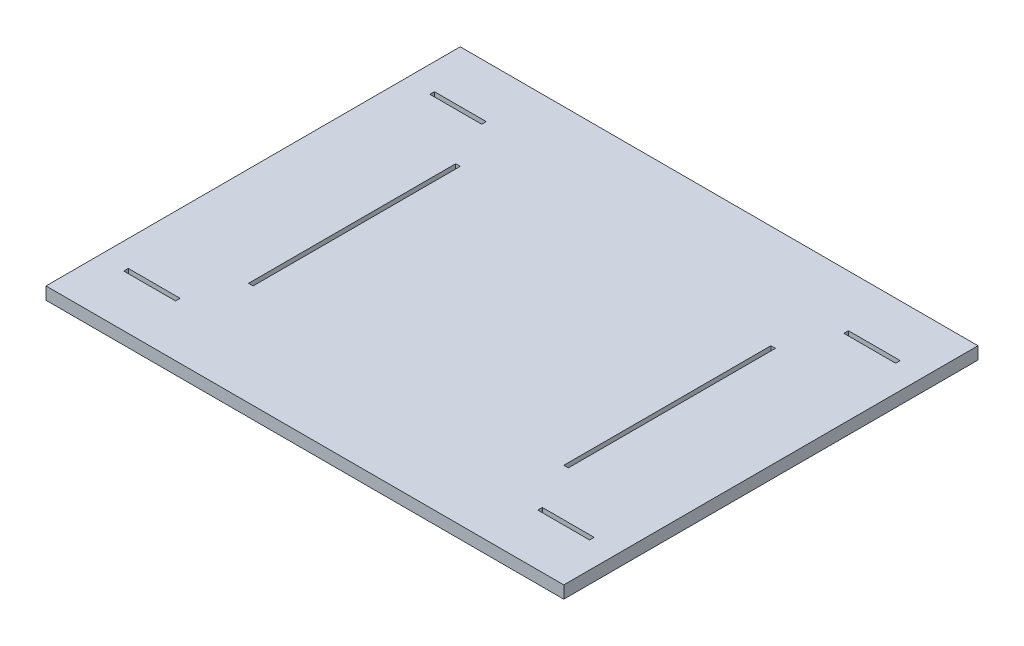
ISO-10303-21;
HEADER;
FILE_DESCRIPTION(('STEP AP214'),'2;1');
FILE_NAME('part.step','',(''),(''),'','','');
FILE_SCHEMA(('AUTOMOTIVE_DESIGN { 1 0 10303 214 1 1 1 1 }'));
ENDSEC;
DATA;
#1=APPLICATION_CONTEXT('core data for automotive mechanical design processes');
#2=APPLICATION_PROTOCOL_DEFINITION('international standard','automotive_design',2000,#1);
#3=PRODUCT_CONTEXT('',#1,'mechanical');
#4=PRODUCT('Part','Part','',(#3));
#5=PRODUCT_RELATED_PRODUCT_CATEGORY('part','',(#4));
#6=PRODUCT_DEFINITION_FORMATION('','',#4);
#7=PRODUCT_DEFINITION_CONTEXT('part definition',#1,'design');
#8=PRODUCT_DEFINITION('design','',#6,#7);
#9=PRODUCT_DEFINITION_SHAPE('','',#8);
#10=(LENGTH_UNIT() NAMED_UNIT(*) SI_UNIT(.MILLI.,.METRE.));
#11=(NAMED_UNIT(*) PLANE_ANGLE_UNIT() SI_UNIT($,.RADIAN.));
#12=(NAMED_UNIT(*) SI_UNIT($,.STERADIAN.) SOLID_ANGLE_UNIT());
#13=UNCERTAINTY_MEASURE_WITH_UNIT(LENGTH_MEASURE(1.E-05),#10,'distance_accuracy_value','');
#14=(GEOMETRIC_REPRESENTATION_CONTEXT(3) GLOBAL_UNCERTAINTY_ASSIGNED_CONTEXT((#13)) GLOBAL_UNIT_ASSIGNED_CONTEXT((#10,
#11,#12)) REPRESENTATION_CONTEXT('',''));
#15=CARTESIAN_POINT('',(0.,0.,0.));
#16=DIRECTION('',(0.,0.,1.));
#17=DIRECTION('',(1.,0.,0.));
#18=AXIS2_PLACEMENT_3D('',#15,#16,#17);
#19=CARTESIAN_POINT('',(-250.,12.,-200.));
#20=DIRECTION('',(0.,0.,-1.));
#21=DIRECTION('',(-1.,0.,0.));
#22=AXIS2_PLACEMENT_3D('',#19,#20,#21);
#23=PLANE('',#22);
#24=DIRECTION('',(1.,0.,0.));
#25=VECTOR('',#24,1.);
#26=CARTESIAN_POINT('',(-250.,0.,-200.));
#27=LINE('',#26,#25);
#28=CARTESIAN_POINT('',(-250.,0.,-200.));
#29=VERTEX_POINT('',#28);
#30=CARTESIAN_POINT('',(250.,0.,-200.));
#31=VERTEX_POINT('',#30);
#32=EDGE_CURVE('E317',#29,#31,#27,.T.);
#33=ORIENTED_EDGE('',*,*,#32,.F.);
#34=DIRECTION('',(0.,-1.,0.));
#35=VECTOR('',#34,1.);
#36=CARTESIAN_POINT('',(-250.,12.,-200.));
#37=LINE('',#36,#35);
#38=CARTESIAN_POINT('',(-250.,12.,-200.));
#39=VERTEX_POINT('',#38);
#40=EDGE_CURVE('E12',#39,#29,#37,.T.);
#41=ORIENTED_EDGE('',*,*,#40,.F.);
#42=DIRECTION('',(1.,0.,0.));
#43=VECTOR('',#42,1.);
#44=CARTESIAN_POINT('',(-250.,12.,-200.));
#45=LINE('',#44,#43);
#46=CARTESIAN_POINT('',(250.,12.,-200.));
#47=VERTEX_POINT('',#46);
#48=EDGE_CURVE('E345',#39,#47,#45,.T.);
#49=ORIENTED_EDGE('',*,*,#48,.T.);
#50=DIRECTION('',(0.,-1.,0.));
#51=VECTOR('',#50,1.);
#52=CARTESIAN_POINT('',(250.,12.,-200.));
#53=LINE('',#52,#51);
#54=EDGE_CURVE('E49',#47,#31,#53,.T.);
#55=ORIENTED_EDGE('',*,*,#54,.T.);
#56=EDGE_LOOP('',(#33,#41,#49,#55));
#57=FACE_BOUND('',#56,.T.);
#58=ADVANCED_FACE('F46',(#57),#23,.T.);
#59=CARTESIAN_POINT('',(-250.,12.,-200.));
#60=DIRECTION('',(1.,0.,0.));
#61=DIRECTION('',(0.,0.,-1.));
#62=AXIS2_PLACEMENT_3D('',#59,#60,#61);
#63=PLANE('',#62);
#64=DIRECTION('',(0.,0.,1.));
#65=VECTOR('',#64,1.);
#66=CARTESIAN_POINT('',(-250.,0.,-200.));
#67=LINE('',#66,#65);
#68=CARTESIAN_POINT('',(-250.,0.,200.));
#69=VERTEX_POINT('',#68);
#70=EDGE_CURVE('E343',#29,#69,#67,.T.);
#71=ORIENTED_EDGE('',*,*,#70,.T.);
#72=DIRECTION('',(0.,-1.,0.));
#73=VECTOR('',#72,1.);
#74=CARTESIAN_POINT('',(-250.,12.,200.));
#75=LINE('',#74,#73);
#76=CARTESIAN_POINT('',(-250.,12.,200.));
#77=VERTEX_POINT('',#76);
#78=EDGE_CURVE('E55',#77,#69,#75,.T.);
#79=ORIENTED_EDGE('',*,*,#78,.F.);
#80=DIRECTION('',(0.,0.,1.));
#81=VECTOR('',#80,1.);
#82=CARTESIAN_POINT('',(-250.,12.,-200.));
#83=LINE('',#82,#81);
#84=EDGE_CURVE('E336',#39,#77,#83,.T.);
#85=ORIENTED_EDGE('',*,*,#84,.F.);
#86=ORIENTED_EDGE('',*,*,#40,.T.);
#87=EDGE_LOOP('',(#71,#79,#85,#86));
#88=FACE_BOUND('',#87,.T.);
#89=ADVANCED_FACE('F307',(#88),#63,.F.);
#90=CARTESIAN_POINT('',(-250.,12.,200.));
#91=DIRECTION('',(0.,0.,-1.));
#92=DIRECTION('',(-1.,0.,0.));
#93=AXIS2_PLACEMENT_3D('',#90,#91,#92);
#94=PLANE('',#93);
#95=DIRECTION('',(1.,0.,0.));
#96=VECTOR('',#95,1.);
#97=CARTESIAN_POINT('',(-250.,0.,200.));
#98=LINE('',#97,#96);
#99=CARTESIAN_POINT('',(250.,0.,200.));
#100=VERTEX_POINT('',#99);
#101=EDGE_CURVE('E330',#69,#100,#98,.T.);
#102=ORIENTED_EDGE('',*,*,#101,.T.);
#103=DIRECTION('',(0.,-1.,0.));
#104=VECTOR('',#103,1.);
#105=CARTESIAN_POINT('',(250.,12.,200.));
#106=LINE('',#105,#104);
#107=CARTESIAN_POINT('',(250.,12.,200.));
#108=VERTEX_POINT('',#107);
#109=EDGE_CURVE('E349',#108,#100,#106,.T.);
#110=ORIENTED_EDGE('',*,*,#109,.F.);
#111=DIRECTION('',(1.,0.,0.));
#112=VECTOR('',#111,1.);
#113=CARTESIAN_POINT('',(-250.,12.,200.));
#114=LINE('',#113,#112);
#115=EDGE_CURVE('E356',#77,#108,#114,.T.);
#116=ORIENTED_EDGE('',*,*,#115,.F.);
#117=ORIENTED_EDGE('',*,*,#78,.T.);
#118=EDGE_LOOP('',(#102,#110,#116,#117));
#119=FACE_BOUND('',#118,.T.);
#120=ADVANCED_FACE('F312',(#119),#94,.F.);
#121=CARTESIAN_POINT('',(250.,12.,-200.));
#122=DIRECTION('',(1.,0.,0.));
#123=DIRECTION('',(0.,0.,-1.));
#124=AXIS2_PLACEMENT_3D('',#121,#122,#123);
#125=PLANE('',#124);
#126=DIRECTION('',(0.,0.,1.));
#127=VECTOR('',#126,1.);
#128=CARTESIAN_POINT('',(250.,0.,-200.));
#129=LINE('',#128,#127);
#130=EDGE_CURVE('E325',#31,#100,#129,.T.);
#131=ORIENTED_EDGE('',*,*,#130,.F.);
#132=ORIENTED_EDGE('',*,*,#54,.F.);
#133=DIRECTION('',(0.,0.,1.));
#134=VECTOR('',#133,1.);
#135=CARTESIAN_POINT('',(250.,12.,-200.));
#136=LINE('',#135,#134);
#137=EDGE_CURVE('E361',#47,#108,#136,.T.);
#138=ORIENTED_EDGE('',*,*,#137,.T.);
#139=ORIENTED_EDGE('',*,*,#109,.T.);
#140=EDGE_LOOP('',(#131,#132,#138,#139));
#141=FACE_BOUND('',#140,.T.);
#142=ADVANCED_FACE('F452',(#141),#125,.T.);
#143=CARTESIAN_POINT('',(0.,12.,0.));
#144=DIRECTION('',(0.,-1.,0.));
#145=DIRECTION('',(0.,0.,-1.));
#146=AXIS2_PLACEMENT_3D('',#143,#144,#145);
#147=PLANE('',#146);
#148=DIRECTION('',(0.,0.,-1.));
#149=VECTOR('',#148,1.);
#150=CARTESIAN_POINT('',(224.9,12.,150.));
#151=LINE('',#150,#149);
#152=CARTESIAN_POINT('',(224.9,12.,150.));
#153=VERTEX_POINT('',#152);
#154=CARTESIAN_POINT('',(224.9,12.,145.6));
#155=VERTEX_POINT('',#154);
#156=EDGE_CURVE('E253',#153,#155,#151,.T.);
#157=ORIENTED_EDGE('',*,*,#156,.F.);
#158=DIRECTION('',(1.,0.,0.));
#159=VECTOR('',#158,1.);
#160=CARTESIAN_POINT('',(224.9,12.,150.));
#161=LINE('',#160,#159);
#162=CARTESIAN_POINT('',(174.9,12.,150.));
#163=VERTEX_POINT('',#162);
#164=EDGE_CURVE('E245',#163,#153,#161,.T.);
#165=ORIENTED_EDGE('',*,*,#164,.F.);
#166=DIRECTION('',(0.,0.,1.));
#167=VECTOR('',#166,1.);
#168=CARTESIAN_POINT('',(174.9,12.,150.));
#169=LINE('',#168,#167);
#170=CARTESIAN_POINT('',(174.9,12.,145.6));
#171=VERTEX_POINT('',#170);
#172=EDGE_CURVE('E233',#171,#163,#169,.T.);
#173=ORIENTED_EDGE('',*,*,#172,.F.);
#174=DIRECTION('',(-1.,0.,0.));
#175=VECTOR('',#174,1.);
#176=CARTESIAN_POINT('',(224.9,12.,145.6));
#177=LINE('',#176,#175);
#178=EDGE_CURVE('E63',#155,#171,#177,.T.);
#179=ORIENTED_EDGE('',*,*,#178,.F.);
#180=EDGE_LOOP('',(#157,#165,#173,#179));
#181=FACE_BOUND('',#180,.T.);
#182=DIRECTION('',(0.,0.,1.));
#183=VECTOR('',#182,1.);
#184=CARTESIAN_POINT('',(-174.9,12.,150.));
#185=LINE('',#184,#183);
#186=CARTESIAN_POINT('',(-174.9,12.,145.6));
#187=VERTEX_POINT('',#186);
#188=CARTESIAN_POINT('',(-174.9,12.,150.));
#189=VERTEX_POINT('',#188);
#190=EDGE_CURVE('E259',#187,#189,#185,.T.);
#191=ORIENTED_EDGE('',*,*,#190,.T.);
#192=DIRECTION('',(-1.,0.,0.));
#193=VECTOR('',#192,1.);
#194=CARTESIAN_POINT('',(-224.9,12.,150.));
#195=LINE('',#194,#193);
#196=CARTESIAN_POINT('',(-224.9,12.,150.));
#197=VERTEX_POINT('',#196);
#198=EDGE_CURVE('E952',#189,#197,#195,.T.);
#199=ORIENTED_EDGE('',*,*,#198,.T.);
#200=DIRECTION('',(0.,0.,-1.));
#201=VECTOR('',#200,1.);
#202=CARTESIAN_POINT('',(-224.9,12.,150.));
#203=LINE('',#202,#201);
#204=CARTESIAN_POINT('',(-224.9,12.,145.6));
#205=VERTEX_POINT('',#204);
#206=EDGE_CURVE('E958',#197,#205,#203,.T.);
#207=ORIENTED_EDGE('',*,*,#206,.T.);
#208=DIRECTION('',(1.,0.,0.));
#209=VECTOR('',#208,1.);
#210=CARTESIAN_POINT('',(-224.9,12.,145.6));
#211=LINE('',#210,#209);
#212=EDGE_CURVE('E968',#205,#187,#211,.T.);
#213=ORIENTED_EDGE('',*,*,#212,.T.);
#214=EDGE_LOOP('',(#191,#199,#207,#213));
#215=FACE_BOUND('',#214,.T.);
#216=DIRECTION('',(0.,0.,-1.));
#217=VECTOR('',#216,1.);
#218=CARTESIAN_POINT('',(174.9,12.,-150.));
#219=LINE('',#218,#217);
#220=CARTESIAN_POINT('',(174.9,12.,-145.6));
#221=VERTEX_POINT('',#220);
#222=CARTESIAN_POINT('',(174.9,12.,-150.));
#223=VERTEX_POINT('',#222);
#224=EDGE_CURVE('E905',#221,#223,#219,.T.);
#225=ORIENTED_EDGE('',*,*,#224,.T.);
#226=DIRECTION('',(1.,0.,0.));
#227=VECTOR('',#226,1.);
#228=CARTESIAN_POINT('',(224.9,12.,-150.));
#229=LINE('',#228,#227);
#230=CARTESIAN_POINT('',(224.9,12.,-150.));
#231=VERTEX_POINT('',#230);
#232=EDGE_CURVE('E896',#223,#231,#229,.T.);
#233=ORIENTED_EDGE('',*,*,#232,.T.);
#234=DIRECTION('',(0.,0.,1.));
#235=VECTOR('',#234,1.);
#236=CARTESIAN_POINT('',(224.9,12.,-150.));
#237=LINE('',#236,#235);
#238=CARTESIAN_POINT('',(224.9,12.,-145.6));
#239=VERTEX_POINT('',#238);
#240=EDGE_CURVE('E888',#231,#239,#237,.T.);
#241=ORIENTED_EDGE('',*,*,#240,.T.);
#242=DIRECTION('',(-1.,0.,0.));
#243=VECTOR('',#242,1.);
#244=CARTESIAN_POINT('',(224.9,12.,-145.6));
#245=LINE('',#244,#243);
#246=EDGE_CURVE('E875',#239,#221,#245,.T.);
#247=ORIENTED_EDGE('',*,*,#246,.T.);
#248=EDGE_LOOP('',(#225,#233,#241,#247));
#249=FACE_BOUND('',#248,.T.);
#250=DIRECTION('',(0.,0.,1.));
#251=VECTOR('',#250,1.);
#252=CARTESIAN_POINT('',(-224.9,12.,-150.));
#253=LINE('',#252,#251);
#254=CARTESIAN_POINT('',(-224.9,12.,-150.));
#255=VERTEX_POINT('',#254);
#256=CARTESIAN_POINT('',(-224.9,12.,-145.6));
#257=VERTEX_POINT('',#256);
#258=EDGE_CURVE('E865',#255,#257,#253,.T.);
#259=ORIENTED_EDGE('',*,*,#258,.F.);
#260=DIRECTION('',(-1.,0.,0.));
#261=VECTOR('',#260,1.);
#262=CARTESIAN_POINT('',(-224.9,12.,-150.));
#263=LINE('',#262,#261);
#264=CARTESIAN_POINT('',(-174.9,12.,-150.));
#265=VERTEX_POINT('',#264);
#266=EDGE_CURVE('E854',#265,#255,#263,.T.);
#267=ORIENTED_EDGE('',*,*,#266,.F.);
#268=DIRECTION('',(0.,0.,-1.));
#269=VECTOR('',#268,1.);
#270=CARTESIAN_POINT('',(-174.9,12.,-150.));
#271=LINE('',#270,#269);
#272=CARTESIAN_POINT('',(-174.9,12.,-145.6));
#273=VERTEX_POINT('',#272);
#274=EDGE_CURVE('E849',#273,#265,#271,.T.);
#275=ORIENTED_EDGE('',*,*,#274,.F.);
#276=DIRECTION('',(1.,0.,0.));
#277=VECTOR('',#276,1.);
#278=CARTESIAN_POINT('',(-224.9,12.,-145.6));
#279=LINE('',#278,#277);
#280=EDGE_CURVE('E848',#257,#273,#279,.T.);
#281=ORIENTED_EDGE('',*,*,#280,.F.);
#282=EDGE_LOOP('',(#259,#267,#275,#281));
#283=FACE_BOUND('',#282,.T.);
#284=DIRECTION('',(-1.,0.,1.1985362197658E-13));
#285=VECTOR('',#284,1.);
#286=CARTESIAN_POINT('',(154.4,12.,-100.));
#287=LINE('',#286,#285);
#288=CARTESIAN_POINT('',(154.4,12.,-100.));
#289=VERTEX_POINT('',#288);
#290=CARTESIAN_POINT('',(150.,12.,-99.9999999999995));
#291=VERTEX_POINT('',#290);
#292=EDGE_CURVE('E781',#289,#291,#287,.T.);
#293=ORIENTED_EDGE('',*,*,#292,.F.);
#294=DIRECTION('',(0.,0.,1.));
#295=VECTOR('',#294,1.);
#296=CARTESIAN_POINT('',(154.4,12.,-100.));
#297=LINE('',#296,#295);
#298=CARTESIAN_POINT('',(154.4,12.,100.));
#299=VERTEX_POINT('',#298);
#300=EDGE_CURVE('E768',#289,#299,#297,.T.);
#301=ORIENTED_EDGE('',*,*,#300,.T.);
#302=DIRECTION('',(-1.,0.,1.1985362197658E-13));
#303=VECTOR('',#302,1.);
#304=CARTESIAN_POINT('',(154.4,12.,100.));
#305=LINE('',#304,#303);
#306=CARTESIAN_POINT('',(150.,12.,100.000000000001));
#307=VERTEX_POINT('',#306);
#308=EDGE_CURVE('E791',#299,#307,#305,.T.);
#309=ORIENTED_EDGE('',*,*,#308,.T.);
#310=DIRECTION('',(0.,0.,1.));
#311=VECTOR('',#310,1.);
#312=CARTESIAN_POINT('',(150.,12.,-99.9999999999995));
#313=LINE('',#312,#311);
#314=EDGE_CURVE('E806',#291,#307,#313,.T.);
#315=ORIENTED_EDGE('',*,*,#314,.F.);
#316=EDGE_LOOP('',(#293,#301,#309,#315));
#317=FACE_BOUND('',#316,.T.);
#318=DIRECTION('',(1.,0.,1.1985362197658E-13));
#319=VECTOR('',#318,1.);
#320=CARTESIAN_POINT('',(-154.4,12.,100.));
#321=LINE('',#320,#319);
#322=CARTESIAN_POINT('',(-154.4,12.,100.));
#323=VERTEX_POINT('',#322);
#324=CARTESIAN_POINT('',(-150.,12.,100.000000000001));
#325=VERTEX_POINT('',#324);
#326=EDGE_CURVE('E404',#323,#325,#321,.T.);
#327=ORIENTED_EDGE('',*,*,#326,.F.);
#328=DIRECTION('',(0.,0.,1.));
#329=VECTOR('',#328,1.);
#330=CARTESIAN_POINT('',(-154.4,12.,-100.));
#331=LINE('',#330,#329);
#332=CARTESIAN_POINT('',(-154.4,12.,-100.));
#333=VERTEX_POINT('',#332);
#334=EDGE_CURVE('E397',#333,#323,#331,.T.);
#335=ORIENTED_EDGE('',*,*,#334,.F.);
#336=DIRECTION('',(1.,0.,1.1985362197658E-13));
#337=VECTOR('',#336,1.);
#338=CARTESIAN_POINT('',(-154.4,12.,-100.));
#339=LINE('',#338,#337);
#340=CARTESIAN_POINT('',(-150.,12.,-99.9999999999995));
#341=VERTEX_POINT('',#340);
#342=EDGE_CURVE('E326',#333,#341,#339,.T.);
#343=ORIENTED_EDGE('',*,*,#342,.T.);
#344=DIRECTION('',(0.,0.,1.));
#345=VECTOR('',#344,1.);
#346=CARTESIAN_POINT('',(-150.,12.,-99.9999999999995));
#347=LINE('',#346,#345);
#348=EDGE_CURVE('E378',#341,#325,#347,.T.);
#349=ORIENTED_EDGE('',*,*,#348,.T.);
#350=EDGE_LOOP('',(#327,#335,#343,#349));
#351=FACE_BOUND('',#350,.T.);
#352=ORIENTED_EDGE('',*,*,#48,.F.);
#353=ORIENTED_EDGE('',*,*,#84,.T.);
#354=ORIENTED_EDGE('',*,*,#115,.T.);
#355=ORIENTED_EDGE('',*,*,#137,.F.);
#356=EDGE_LOOP('',(#352,#353,#354,#355));
#357=FACE_BOUND('',#356,.T.);
#358=ADVANCED_FACE('F250',(#181,#215,#249,#283,#317,#351,#357),#147,.F.);
#359=CARTESIAN_POINT('',(0.,0.,0.));
#360=DIRECTION('',(0.,-1.,0.));
#361=DIRECTION('',(0.,0.,-1.));
#362=AXIS2_PLACEMENT_3D('',#359,#360,#361);
#363=PLANE('',#362);
#364=DIRECTION('',(1.,0.,0.));
#365=VECTOR('',#364,1.);
#366=CARTESIAN_POINT('',(224.9,0.,150.));
#367=LINE('',#366,#365);
#368=CARTESIAN_POINT('',(174.9,0.,150.));
#369=VERTEX_POINT('',#368);
#370=CARTESIAN_POINT('',(224.9,0.,150.));
#371=VERTEX_POINT('',#370);
#372=EDGE_CURVE('E71',#369,#371,#367,.T.);
#373=ORIENTED_EDGE('',*,*,#372,.T.);
#374=DIRECTION('',(0.,0.,-1.));
#375=VECTOR('',#374,1.);
#376=CARTESIAN_POINT('',(224.9,0.,150.));
#377=LINE('',#376,#375);
#378=CARTESIAN_POINT('',(224.9,0.,145.6));
#379=VERTEX_POINT('',#378);
#380=EDGE_CURVE('E255',#371,#379,#377,.T.);
#381=ORIENTED_EDGE('',*,*,#380,.T.);
#382=DIRECTION('',(-1.,0.,0.));
#383=VECTOR('',#382,1.);
#384=CARTESIAN_POINT('',(224.9,0.,145.6));
#385=LINE('',#384,#383);
#386=CARTESIAN_POINT('',(174.9,0.,145.6));
#387=VERTEX_POINT('',#386);
#388=EDGE_CURVE('E282',#379,#387,#385,.T.);
#389=ORIENTED_EDGE('',*,*,#388,.T.);
#390=DIRECTION('',(0.,0.,1.));
#391=VECTOR('',#390,1.);
#392=CARTESIAN_POINT('',(174.9,0.,150.));
#393=LINE('',#392,#391);
#394=EDGE_CURVE('E241',#387,#369,#393,.T.);
#395=ORIENTED_EDGE('',*,*,#394,.T.);
#396=EDGE_LOOP('',(#373,#381,#389,#395));
#397=FACE_BOUND('',#396,.T.);
#398=DIRECTION('',(-1.,0.,0.));
#399=VECTOR('',#398,1.);
#400=CARTESIAN_POINT('',(-224.9,0.,150.));
#401=LINE('',#400,#399);
#402=CARTESIAN_POINT('',(-174.9,0.,150.));
#403=VERTEX_POINT('',#402);
#404=CARTESIAN_POINT('',(-224.9,0.,150.));
#405=VERTEX_POINT('',#404);
#406=EDGE_CURVE('E912',#403,#405,#401,.T.);
#407=ORIENTED_EDGE('',*,*,#406,.F.);
#408=DIRECTION('',(0.,0.,1.));
#409=VECTOR('',#408,1.);
#410=CARTESIAN_POINT('',(-174.9,0.,150.));
#411=LINE('',#410,#409);
#412=CARTESIAN_POINT('',(-174.9,0.,145.6));
#413=VERTEX_POINT('',#412);
#414=EDGE_CURVE('E981',#413,#403,#411,.T.);
#415=ORIENTED_EDGE('',*,*,#414,.F.);
#416=DIRECTION('',(1.,0.,0.));
#417=VECTOR('',#416,1.);
#418=CARTESIAN_POINT('',(-224.9,0.,145.6));
#419=LINE('',#418,#417);
#420=CARTESIAN_POINT('',(-224.9,0.,145.6));
#421=VERTEX_POINT('',#420);
#422=EDGE_CURVE('E965',#421,#413,#419,.T.);
#423=ORIENTED_EDGE('',*,*,#422,.F.);
#424=DIRECTION('',(0.,0.,-1.));
#425=VECTOR('',#424,1.);
#426=CARTESIAN_POINT('',(-224.9,0.,150.));
#427=LINE('',#426,#425);
#428=EDGE_CURVE('E955',#405,#421,#427,.T.);
#429=ORIENTED_EDGE('',*,*,#428,.F.);
#430=EDGE_LOOP('',(#407,#415,#423,#429));
#431=FACE_BOUND('',#430,.T.);
#432=DIRECTION('',(1.,0.,0.));
#433=VECTOR('',#432,1.);
#434=CARTESIAN_POINT('',(224.9,0.,-150.));
#435=LINE('',#434,#433);
#436=CARTESIAN_POINT('',(174.9,0.,-150.));
#437=VERTEX_POINT('',#436);
#438=CARTESIAN_POINT('',(224.9,0.,-150.));
#439=VERTEX_POINT('',#438);
#440=EDGE_CURVE('E855',#437,#439,#435,.T.);
#441=ORIENTED_EDGE('',*,*,#440,.F.);
#442=DIRECTION('',(0.,0.,-1.));
#443=VECTOR('',#442,1.);
#444=CARTESIAN_POINT('',(174.9,0.,-150.));
#445=LINE('',#444,#443);
#446=CARTESIAN_POINT('',(174.9,0.,-145.6));
#447=VERTEX_POINT('',#446);
#448=EDGE_CURVE('E911',#447,#437,#445,.T.);
#449=ORIENTED_EDGE('',*,*,#448,.F.);
#450=DIRECTION('',(-1.,0.,0.));
#451=VECTOR('',#450,1.);
#452=CARTESIAN_POINT('',(224.9,0.,-145.6));
#453=LINE('',#452,#451);
#454=CARTESIAN_POINT('',(224.9,0.,-145.6));
#455=VERTEX_POINT('',#454);
#456=EDGE_CURVE('E881',#455,#447,#453,.T.);
#457=ORIENTED_EDGE('',*,*,#456,.F.);
#458=DIRECTION('',(0.,0.,1.));
#459=VECTOR('',#458,1.);
#460=CARTESIAN_POINT('',(224.9,0.,-150.));
#461=LINE('',#460,#459);
#462=EDGE_CURVE('E893',#439,#455,#461,.T.);
#463=ORIENTED_EDGE('',*,*,#462,.F.);
#464=EDGE_LOOP('',(#441,#449,#457,#463));
#465=FACE_BOUND('',#464,.T.);
#466=DIRECTION('',(-1.,0.,0.));
#467=VECTOR('',#466,1.);
#468=CARTESIAN_POINT('',(-224.9,0.,-150.));
#469=LINE('',#468,#467);
#470=CARTESIAN_POINT('',(-174.9,0.,-150.));
#471=VERTEX_POINT('',#470);
#472=CARTESIAN_POINT('',(-224.9,0.,-150.));
#473=VERTEX_POINT('',#472);
#474=EDGE_CURVE('E827',#471,#473,#469,.T.);
#475=ORIENTED_EDGE('',*,*,#474,.T.);
#476=DIRECTION('',(0.,0.,1.));
#477=VECTOR('',#476,1.);
#478=CARTESIAN_POINT('',(-224.9,0.,-150.));
#479=LINE('',#478,#477);
#480=CARTESIAN_POINT('',(-224.9,0.,-145.6));
#481=VERTEX_POINT('',#480);
#482=EDGE_CURVE('E826',#473,#481,#479,.T.);
#483=ORIENTED_EDGE('',*,*,#482,.T.);
#484=DIRECTION('',(1.,0.,0.));
#485=VECTOR('',#484,1.);
#486=CARTESIAN_POINT('',(-224.9,0.,-145.6));
#487=LINE('',#486,#485);
#488=CARTESIAN_POINT('',(-174.9,0.,-145.6));
#489=VERTEX_POINT('',#488);
#490=EDGE_CURVE('E831',#481,#489,#487,.T.);
#491=ORIENTED_EDGE('',*,*,#490,.T.);
#492=DIRECTION('',(0.,0.,-1.));
#493=VECTOR('',#492,1.);
#494=CARTESIAN_POINT('',(-174.9,0.,-150.));
#495=LINE('',#494,#493);
#496=EDGE_CURVE('E822',#489,#471,#495,.T.);
#497=ORIENTED_EDGE('',*,*,#496,.T.);
#498=EDGE_LOOP('',(#475,#483,#491,#497));
#499=FACE_BOUND('',#498,.T.);
#500=DIRECTION('',(0.,0.,1.));
#501=VECTOR('',#500,1.);
#502=CARTESIAN_POINT('',(154.4,0.,-100.));
#503=LINE('',#502,#501);
#504=CARTESIAN_POINT('',(154.4,0.,-100.));
#505=VERTEX_POINT('',#504);
#506=CARTESIAN_POINT('',(154.4,0.,100.));
#507=VERTEX_POINT('',#506);
#508=EDGE_CURVE('E401',#505,#507,#503,.T.);
#509=ORIENTED_EDGE('',*,*,#508,.F.);
#510=DIRECTION('',(-1.,0.,1.1985362197658E-13));
#511=VECTOR('',#510,1.);
#512=CARTESIAN_POINT('',(154.4,0.,-100.));
#513=LINE('',#512,#511);
#514=CARTESIAN_POINT('',(150.,0.,-99.9999999999995));
#515=VERTEX_POINT('',#514);
#516=EDGE_CURVE('E777',#505,#515,#513,.T.);
#517=ORIENTED_EDGE('',*,*,#516,.T.);
#518=DIRECTION('',(0.,0.,1.));
#519=VECTOR('',#518,1.);
#520=CARTESIAN_POINT('',(150.,0.,-99.9999999999995));
#521=LINE('',#520,#519);
#522=CARTESIAN_POINT('',(150.,0.,100.000000000001));
#523=VERTEX_POINT('',#522);
#524=EDGE_CURVE('E772',#515,#523,#521,.T.);
#525=ORIENTED_EDGE('',*,*,#524,.T.);
#526=DIRECTION('',(-1.,0.,1.1985362197658E-13));
#527=VECTOR('',#526,1.);
#528=CARTESIAN_POINT('',(154.4,0.,100.));
#529=LINE('',#528,#527);
#530=EDGE_CURVE('E785',#507,#523,#529,.T.);
#531=ORIENTED_EDGE('',*,*,#530,.F.);
#532=EDGE_LOOP('',(#509,#517,#525,#531));
#533=FACE_BOUND('',#532,.T.);
#534=DIRECTION('',(0.,0.,1.));
#535=VECTOR('',#534,1.);
#536=CARTESIAN_POINT('',(-154.4,0.,-100.));
#537=LINE('',#536,#535);
#538=CARTESIAN_POINT('',(-154.4,0.,-100.));
#539=VERTEX_POINT('',#538);
#540=CARTESIAN_POINT('',(-154.4,0.,100.));
#541=VERTEX_POINT('',#540);
#542=EDGE_CURVE('E383',#539,#541,#537,.T.);
#543=ORIENTED_EDGE('',*,*,#542,.T.);
#544=DIRECTION('',(1.,0.,1.1985362197658E-13));
#545=VECTOR('',#544,1.);
#546=CARTESIAN_POINT('',(-154.4,0.,100.));
#547=LINE('',#546,#545);
#548=CARTESIAN_POINT('',(-150.,0.,100.000000000001));
#549=VERTEX_POINT('',#548);
#550=EDGE_CURVE('E382',#541,#549,#547,.T.);
#551=ORIENTED_EDGE('',*,*,#550,.T.);
#552=DIRECTION('',(0.,0.,1.));
#553=VECTOR('',#552,1.);
#554=CARTESIAN_POINT('',(-150.,0.,-99.9999999999995));
#555=LINE('',#554,#553);
#556=CARTESIAN_POINT('',(-150.,0.,-99.9999999999995));
#557=VERTEX_POINT('',#556);
#558=EDGE_CURVE('E394',#557,#549,#555,.T.);
#559=ORIENTED_EDGE('',*,*,#558,.F.);
#560=DIRECTION('',(1.,0.,1.1985362197658E-13));
#561=VECTOR('',#560,1.);
#562=CARTESIAN_POINT('',(-154.4,0.,-100.));
#563=LINE('',#562,#561);
#564=EDGE_CURVE('E398',#539,#557,#563,.T.);
#565=ORIENTED_EDGE('',*,*,#564,.F.);
#566=EDGE_LOOP('',(#543,#551,#559,#565));
#567=FACE_BOUND('',#566,.T.);
#568=ORIENTED_EDGE('',*,*,#32,.T.);
#569=ORIENTED_EDGE('',*,*,#130,.T.);
#570=ORIENTED_EDGE('',*,*,#101,.F.);
#571=ORIENTED_EDGE('',*,*,#70,.F.);
#572=EDGE_LOOP('',(#568,#569,#570,#571));
#573=FACE_BOUND('',#572,.T.);
#574=ADVANCED_FACE('F295',(#397,#431,#465,#499,#533,#567,#573),#363,.T.);
#575=CARTESIAN_POINT('',(-154.4,-200.048394145017,-100.));
#576=DIRECTION('',(-1.,0.,0.));
#577=DIRECTION('',(0.,0.,1.));
#578=AXIS2_PLACEMENT_3D('',#575,#576,#577);
#579=PLANE('',#578);
#580=DIRECTION('',(0.,1.,0.));
#581=VECTOR('',#580,1.);
#582=CARTESIAN_POINT('',(-154.4,-200.048394145017,-100.));
#583=LINE('',#582,#581);
#584=EDGE_CURVE('E333',#539,#333,#583,.T.);
#585=ORIENTED_EDGE('',*,*,#584,.T.);
#586=ORIENTED_EDGE('',*,*,#334,.T.);
#587=DIRECTION('',(0.,1.,0.));
#588=VECTOR('',#587,1.);
#589=CARTESIAN_POINT('',(-154.4,-200.048394145017,100.));
#590=LINE('',#589,#588);
#591=EDGE_CURVE('E379',#541,#323,#590,.T.);
#592=ORIENTED_EDGE('',*,*,#591,.F.);
#593=ORIENTED_EDGE('',*,*,#542,.F.);
#594=EDGE_LOOP('',(#585,#586,#592,#593));
#595=FACE_BOUND('',#594,.T.);
#596=ADVANCED_FACE('F440',(#595),#579,.F.);
#597=CARTESIAN_POINT('',(-154.4,-200.048394145017,100.));
#598=DIRECTION('',(-1.1985362197658E-13,0.,1.));
#599=DIRECTION('',(1.,0.,1.1985362197658E-13));
#600=AXIS2_PLACEMENT_3D('',#597,#598,#599);
#601=PLANE('',#600);
#602=ORIENTED_EDGE('',*,*,#591,.T.);
#603=ORIENTED_EDGE('',*,*,#326,.T.);
#604=DIRECTION('',(0.,1.,0.));
#605=VECTOR('',#604,1.);
#606=CARTESIAN_POINT('',(-150.,-200.048394145017,100.000000000001));
#607=LINE('',#606,#605);
#608=EDGE_CURVE('E384',#549,#325,#607,.T.);
#609=ORIENTED_EDGE('',*,*,#608,.F.);
#610=ORIENTED_EDGE('',*,*,#550,.F.);
#611=EDGE_LOOP('',(#602,#603,#609,#610));
#612=FACE_BOUND('',#611,.T.);
#613=ADVANCED_FACE('F424',(#612),#601,.F.);
#614=CARTESIAN_POINT('',(-150.,-200.048394145017,-99.9999999999995));
#615=DIRECTION('',(-1.,0.,0.));
#616=DIRECTION('',(0.,0.,1.));
#617=AXIS2_PLACEMENT_3D('',#614,#615,#616);
#618=PLANE('',#617);
#619=ORIENTED_EDGE('',*,*,#558,.T.);
#620=ORIENTED_EDGE('',*,*,#608,.T.);
#621=ORIENTED_EDGE('',*,*,#348,.F.);
#622=DIRECTION('',(0.,1.,0.));
#623=VECTOR('',#622,1.);
#624=CARTESIAN_POINT('',(-150.,-200.048394145017,-99.9999999999995));
#625=LINE('',#624,#623);
#626=EDGE_CURVE('E387',#557,#341,#625,.T.);
#627=ORIENTED_EDGE('',*,*,#626,.F.);
#628=EDGE_LOOP('',(#619,#620,#621,#627));
#629=FACE_BOUND('',#628,.T.);
#630=ADVANCED_FACE('F432',(#629),#618,.T.);
#631=CARTESIAN_POINT('',(-154.4,-200.048394145017,-100.));
#632=DIRECTION('',(-1.1985362197658E-13,0.,1.));
#633=DIRECTION('',(1.,0.,1.1985362197658E-13));
#634=AXIS2_PLACEMENT_3D('',#631,#632,#633);
#635=PLANE('',#634);
#636=ORIENTED_EDGE('',*,*,#564,.T.);
#637=ORIENTED_EDGE('',*,*,#626,.T.);
#638=ORIENTED_EDGE('',*,*,#342,.F.);
#639=ORIENTED_EDGE('',*,*,#584,.F.);
#640=EDGE_LOOP('',(#636,#637,#638,#639));
#641=FACE_BOUND('',#640,.T.);
#642=ADVANCED_FACE('F435',(#641),#635,.T.);
#643=CARTESIAN_POINT('',(154.4,-200.048394145017,-100.));
#644=DIRECTION('',(1.,0.,0.));
#645=DIRECTION('',(0.,0.,1.));
#646=AXIS2_PLACEMENT_3D('',#643,#644,#645);
#647=PLANE('',#646);
#648=DIRECTION('',(0.,1.,0.));
#649=VECTOR('',#648,1.);
#650=CARTESIAN_POINT('',(154.4,-200.048394145017,-100.));
#651=LINE('',#650,#649);
#652=EDGE_CURVE('E763',#505,#289,#651,.T.);
#653=ORIENTED_EDGE('',*,*,#652,.F.);
#654=ORIENTED_EDGE('',*,*,#508,.T.);
#655=DIRECTION('',(0.,1.,0.));
#656=VECTOR('',#655,1.);
#657=CARTESIAN_POINT('',(154.4,-200.048394145017,100.));
#658=LINE('',#657,#656);
#659=EDGE_CURVE('E804',#507,#299,#658,.T.);
#660=ORIENTED_EDGE('',*,*,#659,.T.);
#661=ORIENTED_EDGE('',*,*,#300,.F.);
#662=EDGE_LOOP('',(#653,#654,#660,#661));
#663=FACE_BOUND('',#662,.T.);
#664=ADVANCED_FACE('F670',(#663),#647,.F.);
#665=CARTESIAN_POINT('',(154.4,-200.048394145017,100.));
#666=DIRECTION('',(1.1985362197658E-13,0.,1.));
#667=DIRECTION('',(-1.,0.,1.1985362197658E-13));
#668=AXIS2_PLACEMENT_3D('',#665,#666,#667);
#669=PLANE('',#668);
#670=ORIENTED_EDGE('',*,*,#659,.F.);
#671=ORIENTED_EDGE('',*,*,#530,.T.);
#672=DIRECTION('',(0.,1.,0.));
#673=VECTOR('',#672,1.);
#674=CARTESIAN_POINT('',(150.,-200.048394145017,100.000000000001));
#675=LINE('',#674,#673);
#676=EDGE_CURVE('E811',#523,#307,#675,.T.);
#677=ORIENTED_EDGE('',*,*,#676,.T.);
#678=ORIENTED_EDGE('',*,*,#308,.F.);
#679=EDGE_LOOP('',(#670,#671,#677,#678));
#680=FACE_BOUND('',#679,.T.);
#681=ADVANCED_FACE('F660',(#680),#669,.F.);
#682=CARTESIAN_POINT('',(150.,-200.048394145017,-99.9999999999995));
#683=DIRECTION('',(1.,0.,0.));
#684=DIRECTION('',(0.,0.,1.));
#685=AXIS2_PLACEMENT_3D('',#682,#683,#684);
#686=PLANE('',#685);
#687=ORIENTED_EDGE('',*,*,#524,.F.);
#688=DIRECTION('',(0.,1.,0.));
#689=VECTOR('',#688,1.);
#690=CARTESIAN_POINT('',(150.,-200.048394145017,-99.9999999999995));
#691=LINE('',#690,#689);
#692=EDGE_CURVE('E773',#515,#291,#691,.T.);
#693=ORIENTED_EDGE('',*,*,#692,.T.);
#694=ORIENTED_EDGE('',*,*,#314,.T.);
#695=ORIENTED_EDGE('',*,*,#676,.F.);
#696=EDGE_LOOP('',(#687,#693,#694,#695));
#697=FACE_BOUND('',#696,.T.);
#698=ADVANCED_FACE('F650',(#697),#686,.T.);
#699=CARTESIAN_POINT('',(154.4,-200.048394145017,-100.));
#700=DIRECTION('',(1.1985362197658E-13,0.,1.));
#701=DIRECTION('',(-1.,0.,1.1985362197658E-13));
#702=AXIS2_PLACEMENT_3D('',#699,#700,#701);
#703=PLANE('',#702);
#704=ORIENTED_EDGE('',*,*,#516,.F.);
#705=ORIENTED_EDGE('',*,*,#652,.T.);
#706=ORIENTED_EDGE('',*,*,#292,.T.);
#707=ORIENTED_EDGE('',*,*,#692,.F.);
#708=EDGE_LOOP('',(#704,#705,#706,#707));
#709=FACE_BOUND('',#708,.T.);
#710=ADVANCED_FACE('F640',(#709),#703,.T.);
#711=CARTESIAN_POINT('',(-224.9,-50.1932266346765,-150.));
#712=DIRECTION('',(0.,0.,-1.));
#713=DIRECTION('',(-1.,0.,0.));
#714=AXIS2_PLACEMENT_3D('',#711,#712,#713);
#715=PLANE('',#714);
#716=DIRECTION('',(0.,1.,0.));
#717=VECTOR('',#716,1.);
#718=CARTESIAN_POINT('',(-174.9,-50.1932266346765,-150.));
#719=LINE('',#718,#717);
#720=EDGE_CURVE('E782',#471,#265,#719,.T.);
#721=ORIENTED_EDGE('',*,*,#720,.T.);
#722=ORIENTED_EDGE('',*,*,#266,.T.);
#723=DIRECTION('',(0.,1.,0.));
#724=VECTOR('',#723,1.);
#725=CARTESIAN_POINT('',(-224.9,-50.1932266346765,-150.));
#726=LINE('',#725,#724);
#727=EDGE_CURVE('E823',#473,#255,#726,.T.);
#728=ORIENTED_EDGE('',*,*,#727,.F.);
#729=ORIENTED_EDGE('',*,*,#474,.F.);
#730=EDGE_LOOP('',(#721,#722,#728,#729));
#731=FACE_BOUND('',#730,.T.);
#732=ADVANCED_FACE('F630',(#731),#715,.F.);
#733=CARTESIAN_POINT('',(-224.9,-50.1932266346765,-150.));
#734=DIRECTION('',(-1.,0.,0.));
#735=DIRECTION('',(0.,0.,1.));
#736=AXIS2_PLACEMENT_3D('',#733,#734,#735);
#737=PLANE('',#736);
#738=ORIENTED_EDGE('',*,*,#727,.T.);
#739=ORIENTED_EDGE('',*,*,#258,.T.);
#740=DIRECTION('',(0.,1.,0.));
#741=VECTOR('',#740,1.);
#742=CARTESIAN_POINT('',(-224.9,-50.1932266346765,-145.6));
#743=LINE('',#742,#741);
#744=EDGE_CURVE('E828',#481,#257,#743,.T.);
#745=ORIENTED_EDGE('',*,*,#744,.F.);
#746=ORIENTED_EDGE('',*,*,#482,.F.);
#747=EDGE_LOOP('',(#738,#739,#745,#746));
#748=FACE_BOUND('',#747,.T.);
#749=ADVANCED_FACE('F620',(#748),#737,.F.);
#750=CARTESIAN_POINT('',(-224.9,-50.1932266346765,-145.6));
#751=DIRECTION('',(0.,0.,1.));
#752=DIRECTION('',(1.,0.,0.));
#753=AXIS2_PLACEMENT_3D('',#750,#751,#752);
#754=PLANE('',#753);
#755=ORIENTED_EDGE('',*,*,#744,.T.);
#756=ORIENTED_EDGE('',*,*,#280,.T.);
#757=DIRECTION('',(0.,1.,0.));
#758=VECTOR('',#757,1.);
#759=CARTESIAN_POINT('',(-174.9,-50.1932266346765,-145.6));
#760=LINE('',#759,#758);
#761=EDGE_CURVE('E832',#489,#273,#760,.T.);
#762=ORIENTED_EDGE('',*,*,#761,.F.);
#763=ORIENTED_EDGE('',*,*,#490,.F.);
#764=EDGE_LOOP('',(#755,#756,#762,#763));
#765=FACE_BOUND('',#764,.T.);
#766=ADVANCED_FACE('F611',(#765),#754,.F.);
#767=CARTESIAN_POINT('',(-174.9,-50.1932266346765,-150.));
#768=DIRECTION('',(1.,0.,0.));
#769=DIRECTION('',(0.,0.,-1.));
#770=AXIS2_PLACEMENT_3D('',#767,#768,#769);
#771=PLANE('',#770);
#772=ORIENTED_EDGE('',*,*,#761,.T.);
#773=ORIENTED_EDGE('',*,*,#274,.T.);
#774=ORIENTED_EDGE('',*,*,#720,.F.);
#775=ORIENTED_EDGE('',*,*,#496,.F.);
#776=EDGE_LOOP('',(#772,#773,#774,#775));
#777=FACE_BOUND('',#776,.T.);
#778=ADVANCED_FACE('F484',(#777),#771,.F.);
#779=CARTESIAN_POINT('',(224.9,-50.1932266346765,-150.));
#780=DIRECTION('',(0.,0.,-1.));
#781=DIRECTION('',(1.,0.,0.));
#782=AXIS2_PLACEMENT_3D('',#779,#780,#781);
#783=PLANE('',#782);
#784=DIRECTION('',(0.,1.,0.));
#785=VECTOR('',#784,1.);
#786=CARTESIAN_POINT('',(174.9,-50.1932266346765,-150.));
#787=LINE('',#786,#785);
#788=EDGE_CURVE('E919',#437,#223,#787,.T.);
#789=ORIENTED_EDGE('',*,*,#788,.F.);
#790=ORIENTED_EDGE('',*,*,#440,.T.);
#791=DIRECTION('',(0.,1.,0.));
#792=VECTOR('',#791,1.);
#793=CARTESIAN_POINT('',(224.9,-50.1932266346765,-150.));
#794=LINE('',#793,#792);
#795=EDGE_CURVE('E886',#439,#231,#794,.T.);
#796=ORIENTED_EDGE('',*,*,#795,.T.);
#797=ORIENTED_EDGE('',*,*,#232,.F.);
#798=EDGE_LOOP('',(#789,#790,#796,#797));
#799=FACE_BOUND('',#798,.T.);
#800=ADVANCED_FACE('F478',(#799),#783,.F.);
#801=CARTESIAN_POINT('',(224.9,-50.1932266346765,-150.));
#802=DIRECTION('',(1.,0.,0.));
#803=DIRECTION('',(0.,0.,1.));
#804=AXIS2_PLACEMENT_3D('',#801,#802,#803);
#805=PLANE('',#804);
#806=ORIENTED_EDGE('',*,*,#795,.F.);
#807=ORIENTED_EDGE('',*,*,#462,.T.);
#808=DIRECTION('',(0.,1.,0.));
#809=VECTOR('',#808,1.);
#810=CARTESIAN_POINT('',(224.9,-50.1932266346765,-145.6));
#811=LINE('',#810,#809);
#812=EDGE_CURVE('E882',#455,#239,#811,.T.);
#813=ORIENTED_EDGE('',*,*,#812,.T.);
#814=ORIENTED_EDGE('',*,*,#240,.F.);
#815=EDGE_LOOP('',(#806,#807,#813,#814));
#816=FACE_BOUND('',#815,.T.);
#817=ADVANCED_FACE('F483',(#816),#805,.F.);
#818=CARTESIAN_POINT('',(224.9,-50.1932266346765,-145.6));
#819=DIRECTION('',(0.,0.,1.));
#820=DIRECTION('',(-1.,0.,0.));
#821=AXIS2_PLACEMENT_3D('',#818,#819,#820);
#822=PLANE('',#821);
#823=ORIENTED_EDGE('',*,*,#812,.F.);
#824=ORIENTED_EDGE('',*,*,#456,.T.);
#825=DIRECTION('',(0.,1.,0.));
#826=VECTOR('',#825,1.);
#827=CARTESIAN_POINT('',(174.9,-50.1932266346765,-145.6));
#828=LINE('',#827,#826);
#829=EDGE_CURVE('E917',#447,#221,#828,.T.);
#830=ORIENTED_EDGE('',*,*,#829,.T.);
#831=ORIENTED_EDGE('',*,*,#246,.F.);
#832=EDGE_LOOP('',(#823,#824,#830,#831));
#833=FACE_BOUND('',#832,.T.);
#834=ADVANCED_FACE('F497',(#833),#822,.F.);
#835=CARTESIAN_POINT('',(174.9,-50.1932266346765,-150.));
#836=DIRECTION('',(-1.,0.,0.));
#837=DIRECTION('',(0.,0.,-1.));
#838=AXIS2_PLACEMENT_3D('',#835,#836,#837);
#839=PLANE('',#838);
#840=ORIENTED_EDGE('',*,*,#829,.F.);
#841=ORIENTED_EDGE('',*,*,#448,.T.);
#842=ORIENTED_EDGE('',*,*,#788,.T.);
#843=ORIENTED_EDGE('',*,*,#224,.F.);
#844=EDGE_LOOP('',(#840,#841,#842,#843));
#845=FACE_BOUND('',#844,.T.);
#846=ADVANCED_FACE('F508',(#845),#839,.F.);
#847=CARTESIAN_POINT('',(-224.9,-50.1932266346765,150.));
#848=DIRECTION('',(0.,0.,1.));
#849=DIRECTION('',(-1.,0.,0.));
#850=AXIS2_PLACEMENT_3D('',#847,#848,#849);
#851=PLANE('',#850);
#852=DIRECTION('',(0.,1.,0.));
#853=VECTOR('',#852,1.);
#854=CARTESIAN_POINT('',(-174.9,-50.1932266346765,150.));
#855=LINE('',#854,#853);
#856=EDGE_CURVE('E974',#403,#189,#855,.T.);
#857=ORIENTED_EDGE('',*,*,#856,.F.);
#858=ORIENTED_EDGE('',*,*,#406,.T.);
#859=DIRECTION('',(0.,1.,0.));
#860=VECTOR('',#859,1.);
#861=CARTESIAN_POINT('',(-224.9,-50.1932266346765,150.));
#862=LINE('',#861,#860);
#863=EDGE_CURVE('E962',#405,#197,#862,.T.);
#864=ORIENTED_EDGE('',*,*,#863,.T.);
#865=ORIENTED_EDGE('',*,*,#198,.F.);
#866=EDGE_LOOP('',(#857,#858,#864,#865));
#867=FACE_BOUND('',#866,.T.);
#868=ADVANCED_FACE('F519',(#867),#851,.F.);
#869=CARTESIAN_POINT('',(-224.9,-50.1932266346765,150.));
#870=DIRECTION('',(-1.,0.,0.));
#871=DIRECTION('',(0.,0.,-1.));
#872=AXIS2_PLACEMENT_3D('',#869,#870,#871);
#873=PLANE('',#872);
#874=ORIENTED_EDGE('',*,*,#863,.F.);
#875=ORIENTED_EDGE('',*,*,#428,.T.);
#876=DIRECTION('',(0.,1.,0.));
#877=VECTOR('',#876,1.);
#878=CARTESIAN_POINT('',(-224.9,-50.1932266346765,145.6));
#879=LINE('',#878,#877);
#880=EDGE_CURVE('E972',#421,#205,#879,.T.);
#881=ORIENTED_EDGE('',*,*,#880,.T.);
#882=ORIENTED_EDGE('',*,*,#206,.F.);
#883=EDGE_LOOP('',(#874,#875,#881,#882));
#884=FACE_BOUND('',#883,.T.);
#885=ADVANCED_FACE('F530',(#884),#873,.F.);
#886=CARTESIAN_POINT('',(-224.9,-50.1932266346765,145.6));
#887=DIRECTION('',(0.,0.,-1.));
#888=DIRECTION('',(1.,0.,0.));
#889=AXIS2_PLACEMENT_3D('',#886,#887,#888);
#890=PLANE('',#889);
#891=ORIENTED_EDGE('',*,*,#880,.F.);
#892=ORIENTED_EDGE('',*,*,#422,.T.);
#893=DIRECTION('',(0.,1.,0.));
#894=VECTOR('',#893,1.);
#895=CARTESIAN_POINT('',(-174.9,-50.1932266346765,145.6));
#896=LINE('',#895,#894);
#897=EDGE_CURVE('E978',#413,#187,#896,.T.);
#898=ORIENTED_EDGE('',*,*,#897,.T.);
#899=ORIENTED_EDGE('',*,*,#212,.F.);
#900=EDGE_LOOP('',(#891,#892,#898,#899));
#901=FACE_BOUND('',#900,.T.);
#902=ADVANCED_FACE('F541',(#901),#890,.F.);
#903=CARTESIAN_POINT('',(-174.9,-50.1932266346765,150.));
#904=DIRECTION('',(1.,0.,0.));
#905=DIRECTION('',(0.,0.,1.));
#906=AXIS2_PLACEMENT_3D('',#903,#904,#905);
#907=PLANE('',#906);
#908=ORIENTED_EDGE('',*,*,#897,.F.);
#909=ORIENTED_EDGE('',*,*,#414,.T.);
#910=ORIENTED_EDGE('',*,*,#856,.T.);
#911=ORIENTED_EDGE('',*,*,#190,.F.);
#912=EDGE_LOOP('',(#908,#909,#910,#911));
#913=FACE_BOUND('',#912,.T.);
#914=ADVANCED_FACE('F552',(#913),#907,.F.);
#915=CARTESIAN_POINT('',(224.9,-50.1932266346765,150.));
#916=DIRECTION('',(0.,0.,1.));
#917=DIRECTION('',(1.,0.,0.));
#918=AXIS2_PLACEMENT_3D('',#915,#916,#917);
#919=PLANE('',#918);
#920=DIRECTION('',(0.,1.,0.));
#921=VECTOR('',#920,1.);
#922=CARTESIAN_POINT('',(174.9,-50.1932266346765,150.));
#923=LINE('',#922,#921);
#924=EDGE_CURVE('E235',#369,#163,#923,.T.);
#925=ORIENTED_EDGE('',*,*,#924,.T.);
#926=ORIENTED_EDGE('',*,*,#164,.T.);
#927=DIRECTION('',(0.,1.,0.));
#928=VECTOR('',#927,1.);
#929=CARTESIAN_POINT('',(224.9,-50.1932266346765,150.));
#930=LINE('',#929,#928);
#931=EDGE_CURVE('E286',#371,#153,#930,.T.);
#932=ORIENTED_EDGE('',*,*,#931,.F.);
#933=ORIENTED_EDGE('',*,*,#372,.F.);
#934=EDGE_LOOP('',(#925,#926,#932,#933));
#935=FACE_BOUND('',#934,.T.);
#936=ADVANCED_FACE('F244',(#935),#919,.F.);
#937=CARTESIAN_POINT('',(224.9,-50.1932266346765,150.));
#938=DIRECTION('',(1.,0.,0.));
#939=DIRECTION('',(0.,0.,-1.));
#940=AXIS2_PLACEMENT_3D('',#937,#938,#939);
#941=PLANE('',#940);
#942=ORIENTED_EDGE('',*,*,#931,.T.);
#943=ORIENTED_EDGE('',*,*,#156,.T.);
#944=DIRECTION('',(0.,1.,0.));
#945=VECTOR('',#944,1.);
#946=CARTESIAN_POINT('',(224.9,-50.1932266346765,145.6));
#947=LINE('',#946,#945);
#948=EDGE_CURVE('E248',#379,#155,#947,.T.);
#949=ORIENTED_EDGE('',*,*,#948,.F.);
#950=ORIENTED_EDGE('',*,*,#380,.F.);
#951=EDGE_LOOP('',(#942,#943,#949,#950));
#952=FACE_BOUND('',#951,.T.);
#953=ADVANCED_FACE('F291',(#952),#941,.F.);
#954=CARTESIAN_POINT('',(224.9,-50.1932266346765,145.6));
#955=DIRECTION('',(0.,0.,-1.));
#956=DIRECTION('',(-1.,0.,0.));
#957=AXIS2_PLACEMENT_3D('',#954,#955,#956);
#958=PLANE('',#957);
#959=ORIENTED_EDGE('',*,*,#948,.T.);
#960=ORIENTED_EDGE('',*,*,#178,.T.);
#961=DIRECTION('',(0.,1.,0.));
#962=VECTOR('',#961,1.);
#963=CARTESIAN_POINT('',(174.9,-50.1932266346765,145.6));
#964=LINE('',#963,#962);
#965=EDGE_CURVE('E237',#387,#171,#964,.T.);
#966=ORIENTED_EDGE('',*,*,#965,.F.);
#967=ORIENTED_EDGE('',*,*,#388,.F.);
#968=EDGE_LOOP('',(#959,#960,#966,#967));
#969=FACE_BOUND('',#968,.T.);
#970=ADVANCED_FACE('F297',(#969),#958,.F.);
#971=CARTESIAN_POINT('',(174.9,-50.1932266346765,150.));
#972=DIRECTION('',(-1.,0.,0.));
#973=DIRECTION('',(0.,0.,1.));
#974=AXIS2_PLACEMENT_3D('',#971,#972,#973);
#975=PLANE('',#974);
#976=ORIENTED_EDGE('',*,*,#965,.T.);
#977=ORIENTED_EDGE('',*,*,#172,.T.);
#978=ORIENTED_EDGE('',*,*,#924,.F.);
#979=ORIENTED_EDGE('',*,*,#394,.F.);
#980=EDGE_LOOP('',(#976,#977,#978,#979));
#981=FACE_BOUND('',#980,.T.);
#982=ADVANCED_FACE('F234',(#981),#975,.F.);
#983=CLOSED_SHELL('',(#58,#89,#120,#142,#358,#574,#596,#613,#630,#642,#664,#681,#698,#710,#732,
#749,#766,#778,#800,#817,#834,#846,#868,#885,#902,#914,#936,#953,#970,#982));
#984=MANIFOLD_SOLID_BREP('B2',#983);
#985=ADVANCED_BREP_SHAPE_REPRESENTATION('',(#18,#984),#14);
#986=SHAPE_DEFINITION_REPRESENTATION(#9,#985);
ENDSEC;
END-ISO-10303-21;
